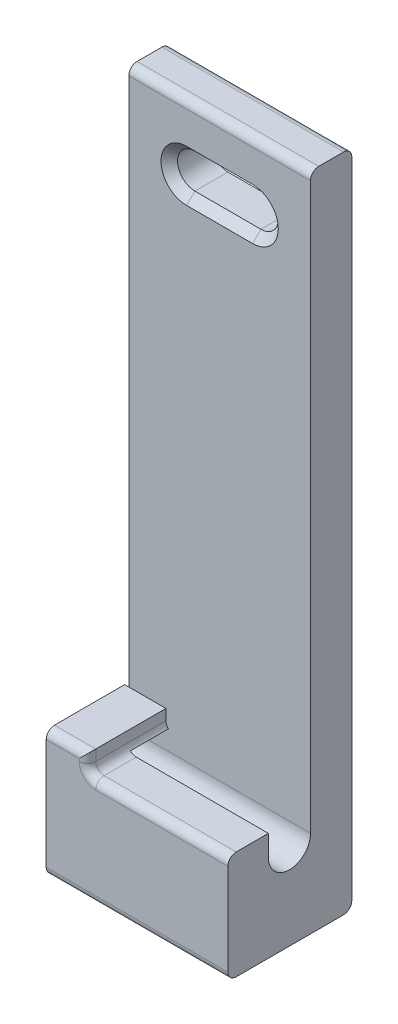
ISO-10303-21;
HEADER;
FILE_DESCRIPTION(('STEP AP214'),'2;1');
FILE_NAME('part.step','',(''),(''),'','','');
FILE_SCHEMA(('AUTOMOTIVE_DESIGN { 1 0 10303 214 1 1 1 1 }'));
ENDSEC;
DATA;
#1=APPLICATION_CONTEXT('core data for automotive mechanical design processes');
#2=APPLICATION_PROTOCOL_DEFINITION('international standard','automotive_design',2000,#1);
#3=PRODUCT_CONTEXT('',#1,'mechanical');
#4=PRODUCT('Part','Part','',(#3));
#5=PRODUCT_RELATED_PRODUCT_CATEGORY('part','',(#4));
#6=PRODUCT_DEFINITION_FORMATION('','',#4);
#7=PRODUCT_DEFINITION_CONTEXT('part definition',#1,'design');
#8=PRODUCT_DEFINITION('design','',#6,#7);
#9=PRODUCT_DEFINITION_SHAPE('','',#8);
#10=(LENGTH_UNIT() NAMED_UNIT(*) SI_UNIT(.MILLI.,.METRE.));
#11=(NAMED_UNIT(*) PLANE_ANGLE_UNIT() SI_UNIT($,.RADIAN.));
#12=(NAMED_UNIT(*) SI_UNIT($,.STERADIAN.) SOLID_ANGLE_UNIT());
#13=UNCERTAINTY_MEASURE_WITH_UNIT(LENGTH_MEASURE(1.E-05),#10,'distance_accuracy_value','');
#14=(GEOMETRIC_REPRESENTATION_CONTEXT(3) GLOBAL_UNCERTAINTY_ASSIGNED_CONTEXT((#13)) GLOBAL_UNIT_ASSIGNED_CONTEXT((#10,
#11,#12)) REPRESENTATION_CONTEXT('',''));
#15=CARTESIAN_POINT('',(0.,0.,0.));
#16=DIRECTION('',(0.,0.,1.));
#17=DIRECTION('',(1.,0.,0.));
#18=AXIS2_PLACEMENT_3D('',#15,#16,#17);
#19=CARTESIAN_POINT('',(0.,13.1,0.));
#20=DIRECTION('',(0.,-1.,0.));
#21=DIRECTION('',(0.,0.,-1.));
#22=AXIS2_PLACEMENT_3D('',#19,#20,#21);
#23=PLANE('',#22);
#24=DIRECTION('',(0.,0.,-1.));
#25=VECTOR('',#24,1.);
#26=CARTESIAN_POINT('',(6.,13.1,15.));
#27=LINE('',#26,#25);
#28=CARTESIAN_POINT('',(6.,13.1,10.1));
#29=VERTEX_POINT('',#28);
#30=CARTESIAN_POINT('',(6.,13.1,14.));
#31=VERTEX_POINT('',#30);
#32=EDGE_CURVE('E472',#29,#31,#27,.F.);
#33=ORIENTED_EDGE('',*,*,#32,.T.);
#34=DIRECTION('',(1.,0.,0.));
#35=VECTOR('',#34,1.);
#36=CARTESIAN_POINT('',(0.,13.1,14.));
#37=LINE('',#36,#35);
#38=CARTESIAN_POINT('',(22.,13.1,14.));
#39=VERTEX_POINT('',#38);
#40=EDGE_CURVE('E475',#31,#39,#37,.T.);
#41=ORIENTED_EDGE('',*,*,#40,.T.);
#42=DIRECTION('',(0.,0.,-1.));
#43=VECTOR('',#42,1.);
#44=CARTESIAN_POINT('',(22.,13.1,0.));
#45=LINE('',#44,#43);
#46=CARTESIAN_POINT('',(22.,13.1,10.1));
#47=VERTEX_POINT('',#46);
#48=EDGE_CURVE('E297',#39,#47,#45,.T.);
#49=ORIENTED_EDGE('',*,*,#48,.T.);
#50=DIRECTION('',(1.,0.,0.));
#51=VECTOR('',#50,1.);
#52=CARTESIAN_POINT('',(0.,13.1,10.1));
#53=LINE('',#52,#51);
#54=EDGE_CURVE('E320',#29,#47,#53,.T.);
#55=ORIENTED_EDGE('',*,*,#54,.F.);
#56=EDGE_LOOP('',(#33,#41,#49,#55));
#57=FACE_BOUND('',#56,.T.);
#58=ADVANCED_FACE('F47',(#57),#23,.F.);
#59=CARTESIAN_POINT('',(22.,0.,0.));
#60=DIRECTION('',(0.,0.,1.));
#61=DIRECTION('',(0.,-1.,0.));
#62=AXIS2_PLACEMENT_3D('',#59,#60,#61);
#63=PLANE('',#62);
#64=DIRECTION('',(-1.,0.,0.));
#65=VECTOR('',#64,1.);
#66=CARTESIAN_POINT('',(7.,74.1,0.));
#67=LINE('',#66,#65);
#68=CARTESIAN_POINT('',(15.,74.1,0.));
#69=VERTEX_POINT('',#68);
#70=CARTESIAN_POINT('',(7.,74.1,0.));
#71=VERTEX_POINT('',#70);
#72=EDGE_CURVE('E271',#69,#71,#67,.T.);
#73=ORIENTED_EDGE('',*,*,#72,.T.);
#74=CARTESIAN_POINT('',(7.,72.,0.));
#75=DIRECTION('',(0.,0.,1.));
#76=DIRECTION('',(1.,0.,0.));
#77=AXIS2_PLACEMENT_3D('',#74,#75,#76);
#78=CIRCLE('',#77,2.1);
#79=CARTESIAN_POINT('',(7.,69.9,0.));
#80=VERTEX_POINT('',#79);
#81=EDGE_CURVE('E258',#71,#80,#78,.T.);
#82=ORIENTED_EDGE('',*,*,#81,.T.);
#83=DIRECTION('',(1.,0.,0.));
#84=VECTOR('',#83,1.);
#85=CARTESIAN_POINT('',(7.,69.9,0.));
#86=LINE('',#85,#84);
#87=CARTESIAN_POINT('',(15.,69.9,0.));
#88=VERTEX_POINT('',#87);
#89=EDGE_CURVE('E262',#80,#88,#86,.T.);
#90=ORIENTED_EDGE('',*,*,#89,.T.);
#91=CARTESIAN_POINT('',(15.,72.,0.));
#92=DIRECTION('',(0.,0.,1.));
#93=DIRECTION('',(1.,0.,0.));
#94=AXIS2_PLACEMENT_3D('',#91,#92,#93);
#95=CIRCLE('',#94,2.1);
#96=EDGE_CURVE('E267',#88,#69,#95,.T.);
#97=ORIENTED_EDGE('',*,*,#96,.T.);
#98=EDGE_LOOP('',(#73,#82,#90,#97));
#99=FACE_BOUND('',#98,.T.);
#100=DIRECTION('',(0.,1.,0.));
#101=VECTOR('',#100,1.);
#102=CARTESIAN_POINT('',(22.,0.,0.));
#103=LINE('',#102,#101);
#104=CARTESIAN_POINT('',(22.,1.,0.));
#105=VERTEX_POINT('',#104);
#106=CARTESIAN_POINT('',(22.,79.,0.));
#107=VERTEX_POINT('',#106);
#108=EDGE_CURVE('E329',#105,#107,#103,.T.);
#109=ORIENTED_EDGE('',*,*,#108,.F.);
#110=DIRECTION('',(-1.,0.,0.));
#111=VECTOR('',#110,1.);
#112=CARTESIAN_POINT('',(22.,1.,0.));
#113=LINE('',#112,#111);
#114=CARTESIAN_POINT('',(0.,1.,0.));
#115=VERTEX_POINT('',#114);
#116=EDGE_CURVE('E420',#105,#115,#113,.T.);
#117=ORIENTED_EDGE('',*,*,#116,.T.);
#118=DIRECTION('',(0.,1.,0.));
#119=VECTOR('',#118,1.);
#120=CARTESIAN_POINT('',(0.,0.,0.));
#121=LINE('',#120,#119);
#122=CARTESIAN_POINT('',(0.,79.,0.));
#123=VERTEX_POINT('',#122);
#124=EDGE_CURVE('E323',#115,#123,#121,.T.);
#125=ORIENTED_EDGE('',*,*,#124,.T.);
#126=DIRECTION('',(-1.,0.,0.));
#127=VECTOR('',#126,1.);
#128=CARTESIAN_POINT('',(22.,79.,0.));
#129=LINE('',#128,#127);
#130=EDGE_CURVE('E417',#123,#107,#129,.F.);
#131=ORIENTED_EDGE('',*,*,#130,.T.);
#132=EDGE_LOOP('',(#109,#117,#125,#131));
#133=FACE_BOUND('',#132,.T.);
#134=ADVANCED_FACE('F552',(#99,#133),#63,.F.);
#135=CARTESIAN_POINT('',(22.,80.,0.));
#136=DIRECTION('',(0.,-1.,0.));
#137=DIRECTION('',(0.,0.,-1.));
#138=AXIS2_PLACEMENT_3D('',#135,#136,#137);
#139=PLANE('',#138);
#140=DIRECTION('',(0.,0.,1.));
#141=VECTOR('',#140,1.);
#142=CARTESIAN_POINT('',(22.,80.,0.));
#143=LINE('',#142,#141);
#144=CARTESIAN_POINT('',(22.,80.,1.));
#145=VERTEX_POINT('',#144);
#146=CARTESIAN_POINT('',(22.,80.,4.));
#147=VERTEX_POINT('',#146);
#148=EDGE_CURVE('E333',#145,#147,#143,.T.);
#149=ORIENTED_EDGE('',*,*,#148,.F.);
#150=DIRECTION('',(-1.,0.,0.));
#151=VECTOR('',#150,1.);
#152=CARTESIAN_POINT('',(22.,80.,1.));
#153=LINE('',#152,#151);
#154=CARTESIAN_POINT('',(0.,80.,1.));
#155=VERTEX_POINT('',#154);
#156=EDGE_CURVE('E465',#145,#155,#153,.T.);
#157=ORIENTED_EDGE('',*,*,#156,.T.);
#158=DIRECTION('',(0.,0.,1.));
#159=VECTOR('',#158,1.);
#160=CARTESIAN_POINT('',(0.,80.,0.));
#161=LINE('',#160,#159);
#162=CARTESIAN_POINT('',(0.,80.,4.));
#163=VERTEX_POINT('',#162);
#164=EDGE_CURVE('E350',#155,#163,#161,.T.);
#165=ORIENTED_EDGE('',*,*,#164,.T.);
#166=DIRECTION('',(1.,0.,0.));
#167=VECTOR('',#166,1.);
#168=CARTESIAN_POINT('',(22.,80.,4.));
#169=LINE('',#168,#167);
#170=EDGE_CURVE('E461',#163,#147,#169,.T.);
#171=ORIENTED_EDGE('',*,*,#170,.T.);
#172=EDGE_LOOP('',(#149,#157,#165,#171));
#173=FACE_BOUND('',#172,.T.);
#174=ADVANCED_FACE('F542',(#173),#139,.F.);
#175=CARTESIAN_POINT('',(22.,0.,15.));
#176=DIRECTION('',(0.,0.,-1.));
#177=DIRECTION('',(0.,1.,0.));
#178=AXIS2_PLACEMENT_3D('',#175,#176,#177);
#179=PLANE('',#178);
#180=DIRECTION('',(0.,-1.,0.));
#181=VECTOR('',#180,1.);
#182=CARTESIAN_POINT('',(0.,0.,15.));
#183=LINE('',#182,#181);
#184=CARTESIAN_POINT('',(0.,14.4,15.));
#185=VERTEX_POINT('',#184);
#186=CARTESIAN_POINT('',(0.,0.999999999999998,15.));
#187=VERTEX_POINT('',#186);
#188=EDGE_CURVE('E354',#185,#187,#183,.T.);
#189=ORIENTED_EDGE('',*,*,#188,.T.);
#190=DIRECTION('',(-1.,0.,0.));
#191=VECTOR('',#190,1.);
#192=CARTESIAN_POINT('',(22.,0.999999999999998,15.));
#193=LINE('',#192,#191);
#194=CARTESIAN_POINT('',(22.,0.999999999999998,15.));
#195=VERTEX_POINT('',#194);
#196=EDGE_CURVE('E409',#187,#195,#193,.F.);
#197=ORIENTED_EDGE('',*,*,#196,.T.);
#198=DIRECTION('',(0.,-1.,0.));
#199=VECTOR('',#198,1.);
#200=CARTESIAN_POINT('',(22.,0.,15.));
#201=LINE('',#200,#199);
#202=CARTESIAN_POINT('',(22.,12.1,15.));
#203=VERTEX_POINT('',#202);
#204=EDGE_CURVE('E338',#203,#195,#201,.T.);
#205=ORIENTED_EDGE('',*,*,#204,.F.);
#206=DIRECTION('',(1.,0.,0.));
#207=VECTOR('',#206,1.);
#208=CARTESIAN_POINT('',(22.,12.1,15.));
#209=LINE('',#208,#207);
#210=CARTESIAN_POINT('',(6.,12.1,15.));
#211=VERTEX_POINT('',#210);
#212=EDGE_CURVE('E406',#203,#211,#209,.F.);
#213=ORIENTED_EDGE('',*,*,#212,.T.);
#214=CARTESIAN_POINT('',(6.,14.1,15.));
#215=DIRECTION('',(0.,0.,-1.));
#216=DIRECTION('',(0.,1.,0.));
#217=AXIS2_PLACEMENT_3D('',#214,#215,#216);
#218=CIRCLE('',#217,2.);
#219=CARTESIAN_POINT('',(4.,14.1,15.));
#220=VERTEX_POINT('',#219);
#221=EDGE_CURVE('E402',#220,#211,#218,.F.);
#222=ORIENTED_EDGE('',*,*,#221,.F.);
#223=DIRECTION('',(0.,1.,0.));
#224=VECTOR('',#223,1.);
#225=CARTESIAN_POINT('',(4.,0.,15.));
#226=LINE('',#225,#224);
#227=CARTESIAN_POINT('',(4.,14.4,15.));
#228=VERTEX_POINT('',#227);
#229=EDGE_CURVE('E398',#220,#228,#226,.T.);
#230=ORIENTED_EDGE('',*,*,#229,.T.);
#231=DIRECTION('',(-1.,0.,0.));
#232=VECTOR('',#231,1.);
#233=CARTESIAN_POINT('',(0.,14.4,15.));
#234=LINE('',#233,#232);
#235=EDGE_CURVE('E385',#228,#185,#234,.T.);
#236=ORIENTED_EDGE('',*,*,#235,.T.);
#237=EDGE_LOOP('',(#189,#197,#205,#213,#222,#230,#236));
#238=FACE_BOUND('',#237,.T.);
#239=ADVANCED_FACE('F567',(#238),#179,.F.);
#240=CARTESIAN_POINT('',(22.,0.,0.));
#241=DIRECTION('',(0.,1.,0.));
#242=DIRECTION('',(0.,0.,1.));
#243=AXIS2_PLACEMENT_3D('',#240,#241,#242);
#244=PLANE('',#243);
#245=DIRECTION('',(0.,0.,-1.));
#246=VECTOR('',#245,1.);
#247=CARTESIAN_POINT('',(0.,0.,0.));
#248=LINE('',#247,#246);
#249=CARTESIAN_POINT('',(0.,0.,14.));
#250=VERTEX_POINT('',#249);
#251=CARTESIAN_POINT('',(0.,0.,1.));
#252=VERTEX_POINT('',#251);
#253=EDGE_CURVE('E334',#250,#252,#248,.T.);
#254=ORIENTED_EDGE('',*,*,#253,.T.);
#255=DIRECTION('',(-1.,0.,0.));
#256=VECTOR('',#255,1.);
#257=CARTESIAN_POINT('',(22.,0.,1.));
#258=LINE('',#257,#256);
#259=CARTESIAN_POINT('',(22.,0.,1.));
#260=VERTEX_POINT('',#259);
#261=EDGE_CURVE('E443',#252,#260,#258,.F.);
#262=ORIENTED_EDGE('',*,*,#261,.T.);
#263=DIRECTION('',(0.,0.,-1.));
#264=VECTOR('',#263,1.);
#265=CARTESIAN_POINT('',(22.,0.,0.));
#266=LINE('',#265,#264);
#267=CARTESIAN_POINT('',(22.,0.,14.));
#268=VERTEX_POINT('',#267);
#269=EDGE_CURVE('E342',#268,#260,#266,.T.);
#270=ORIENTED_EDGE('',*,*,#269,.F.);
#271=DIRECTION('',(-1.,0.,0.));
#272=VECTOR('',#271,1.);
#273=CARTESIAN_POINT('',(22.,0.,14.));
#274=LINE('',#273,#272);
#275=EDGE_CURVE('E439',#268,#250,#274,.T.);
#276=ORIENTED_EDGE('',*,*,#275,.T.);
#277=EDGE_LOOP('',(#254,#262,#270,#276));
#278=FACE_BOUND('',#277,.T.);
#279=ADVANCED_FACE('F560',(#278),#244,.F.);
#280=CARTESIAN_POINT('',(22.,0.,0.));
#281=DIRECTION('',(1.,0.,0.));
#282=DIRECTION('',(0.,0.,-1.));
#283=AXIS2_PLACEMENT_3D('',#280,#281,#282);
#284=PLANE('',#283);
#285=ORIENTED_EDGE('',*,*,#269,.T.);
#286=CARTESIAN_POINT('',(22.,1.,1.));
#287=DIRECTION('',(1.,0.,0.));
#288=DIRECTION('',(0.,0.,-1.));
#289=AXIS2_PLACEMENT_3D('',#286,#287,#288);
#290=CIRCLE('',#289,1.);
#291=EDGE_CURVE('E458',#260,#105,#290,.T.);
#292=ORIENTED_EDGE('',*,*,#291,.T.);
#293=ORIENTED_EDGE('',*,*,#108,.T.);
#294=CARTESIAN_POINT('',(22.,79.,1.));
#295=DIRECTION('',(1.,0.,0.));
#296=DIRECTION('',(0.,0.,-1.));
#297=AXIS2_PLACEMENT_3D('',#294,#295,#296);
#298=CIRCLE('',#297,1.);
#299=EDGE_CURVE('E455',#107,#145,#298,.T.);
#300=ORIENTED_EDGE('',*,*,#299,.T.);
#301=ORIENTED_EDGE('',*,*,#148,.T.);
#302=CARTESIAN_POINT('',(22.,79.,4.));
#303=DIRECTION('',(1.,0.,0.));
#304=DIRECTION('',(0.,0.,-1.));
#305=AXIS2_PLACEMENT_3D('',#302,#303,#304);
#306=CIRCLE('',#305,1.);
#307=CARTESIAN_POINT('',(22.,79.,5.));
#308=VERTEX_POINT('',#307);
#309=EDGE_CURVE('E452',#147,#308,#306,.T.);
#310=ORIENTED_EDGE('',*,*,#309,.T.);
#311=DIRECTION('',(0.,1.,0.));
#312=VECTOR('',#311,1.);
#313=CARTESIAN_POINT('',(22.,0.,5.));
#314=LINE('',#313,#312);
#315=CARTESIAN_POINT('',(22.,10.55,5.));
#316=VERTEX_POINT('',#315);
#317=EDGE_CURVE('E313',#316,#308,#314,.T.);
#318=ORIENTED_EDGE('',*,*,#317,.F.);
#319=CARTESIAN_POINT('',(22.,10.55,7.55));
#320=DIRECTION('',(1.,0.,0.));
#321=DIRECTION('',(0.,0.,-1.));
#322=AXIS2_PLACEMENT_3D('',#319,#320,#321);
#323=CIRCLE('',#322,2.55);
#324=CARTESIAN_POINT('',(22.,10.55,10.1));
#325=VERTEX_POINT('',#324);
#326=EDGE_CURVE('E309',#325,#316,#323,.T.);
#327=ORIENTED_EDGE('',*,*,#326,.F.);
#328=DIRECTION('',(0.,-1.,0.));
#329=VECTOR('',#328,1.);
#330=CARTESIAN_POINT('',(22.,0.,10.1));
#331=LINE('',#330,#329);
#332=EDGE_CURVE('E280',#47,#325,#331,.T.);
#333=ORIENTED_EDGE('',*,*,#332,.F.);
#334=ORIENTED_EDGE('',*,*,#48,.F.);
#335=CARTESIAN_POINT('',(22.,12.1,14.));
#336=DIRECTION('',(1.,0.,0.));
#337=DIRECTION('',(0.,0.,-1.));
#338=AXIS2_PLACEMENT_3D('',#335,#336,#337);
#339=CIRCLE('',#338,1.);
#340=EDGE_CURVE('E449',#39,#203,#339,.T.);
#341=ORIENTED_EDGE('',*,*,#340,.T.);
#342=ORIENTED_EDGE('',*,*,#204,.T.);
#343=CARTESIAN_POINT('',(22.,0.999999999999998,14.));
#344=DIRECTION('',(1.,0.,0.));
#345=DIRECTION('',(0.,0.,-1.));
#346=AXIS2_PLACEMENT_3D('',#343,#344,#345);
#347=CIRCLE('',#346,1.);
#348=EDGE_CURVE('E446',#195,#268,#347,.T.);
#349=ORIENTED_EDGE('',*,*,#348,.T.);
#350=EDGE_LOOP('',(#285,#292,#293,#300,#301,#310,#318,#327,#333,#334,#341,#342,#349));
#351=FACE_BOUND('',#350,.T.);
#352=ADVANCED_FACE('F545',(#351),#284,.T.);
#353=CARTESIAN_POINT('',(0.,0.,0.));
#354=DIRECTION('',(1.,0.,0.));
#355=DIRECTION('',(0.,0.,-1.));
#356=AXIS2_PLACEMENT_3D('',#353,#354,#355);
#357=PLANE('',#356);
#358=ORIENTED_EDGE('',*,*,#124,.F.);
#359=CARTESIAN_POINT('',(0.,1.,1.));
#360=DIRECTION('',(1.,0.,0.));
#361=DIRECTION('',(0.,0.,-1.));
#362=AXIS2_PLACEMENT_3D('',#359,#360,#361);
#363=CIRCLE('',#362,1.);
#364=EDGE_CURVE('E436',#115,#252,#363,.F.);
#365=ORIENTED_EDGE('',*,*,#364,.T.);
#366=ORIENTED_EDGE('',*,*,#253,.F.);
#367=CARTESIAN_POINT('',(0.,0.999999999999998,14.));
#368=DIRECTION('',(1.,0.,0.));
#369=DIRECTION('',(0.,0.,-1.));
#370=AXIS2_PLACEMENT_3D('',#367,#368,#369);
#371=CIRCLE('',#370,1.);
#372=EDGE_CURVE('E427',#250,#187,#371,.F.);
#373=ORIENTED_EDGE('',*,*,#372,.T.);
#374=ORIENTED_EDGE('',*,*,#188,.F.);
#375=CARTESIAN_POINT('',(0.,14.4,14.));
#376=DIRECTION('',(1.,0.,0.));
#377=DIRECTION('',(0.,0.,-1.));
#378=AXIS2_PLACEMENT_3D('',#375,#376,#377);
#379=CIRCLE('',#378,1.);
#380=CARTESIAN_POINT('',(0.,15.4,14.));
#381=VERTEX_POINT('',#380);
#382=EDGE_CURVE('E424',#185,#381,#379,.F.);
#383=ORIENTED_EDGE('',*,*,#382,.T.);
#384=DIRECTION('',(0.,0.,-1.));
#385=VECTOR('',#384,1.);
#386=CARTESIAN_POINT('',(0.,15.4,0.));
#387=LINE('',#386,#385);
#388=CARTESIAN_POINT('',(0.,15.4,5.5));
#389=VERTEX_POINT('',#388);
#390=EDGE_CURVE('E240',#381,#389,#387,.T.);
#391=ORIENTED_EDGE('',*,*,#390,.T.);
#392=DIRECTION('',(0.,1.,0.));
#393=VECTOR('',#392,1.);
#394=CARTESIAN_POINT('',(0.,0.,5.5));
#395=LINE('',#394,#393);
#396=CARTESIAN_POINT('',(0.,13.4,5.5));
#397=VERTEX_POINT('',#396);
#398=EDGE_CURVE('E244',#397,#389,#395,.T.);
#399=ORIENTED_EDGE('',*,*,#398,.F.);
#400=DIRECTION('',(0.,0.,-1.));
#401=VECTOR('',#400,1.);
#402=CARTESIAN_POINT('',(0.,13.4,0.));
#403=LINE('',#402,#401);
#404=CARTESIAN_POINT('',(0.,13.4,10.1));
#405=VERTEX_POINT('',#404);
#406=EDGE_CURVE('E501',#405,#397,#403,.T.);
#407=ORIENTED_EDGE('',*,*,#406,.F.);
#408=DIRECTION('',(0.,-1.,0.));
#409=VECTOR('',#408,1.);
#410=CARTESIAN_POINT('',(0.,0.,10.1));
#411=LINE('',#410,#409);
#412=CARTESIAN_POINT('',(0.,10.55,10.1));
#413=VERTEX_POINT('',#412);
#414=EDGE_CURVE('E292',#405,#413,#411,.T.);
#415=ORIENTED_EDGE('',*,*,#414,.T.);
#416=CARTESIAN_POINT('',(0.,10.55,7.55));
#417=DIRECTION('',(1.,0.,0.));
#418=DIRECTION('',(0.,0.,-1.));
#419=AXIS2_PLACEMENT_3D('',#416,#417,#418);
#420=CIRCLE('',#419,2.55);
#421=CARTESIAN_POINT('',(0.,10.55,5.));
#422=VERTEX_POINT('',#421);
#423=EDGE_CURVE('E296',#413,#422,#420,.T.);
#424=ORIENTED_EDGE('',*,*,#423,.T.);
#425=DIRECTION('',(0.,1.,0.));
#426=VECTOR('',#425,1.);
#427=CARTESIAN_POINT('',(0.,0.,5.));
#428=LINE('',#427,#426);
#429=CARTESIAN_POINT('',(0.,79.,5.));
#430=VERTEX_POINT('',#429);
#431=EDGE_CURVE('E301',#422,#430,#428,.T.);
#432=ORIENTED_EDGE('',*,*,#431,.T.);
#433=CARTESIAN_POINT('',(0.,79.,4.));
#434=DIRECTION('',(1.,0.,0.));
#435=DIRECTION('',(0.,0.,-1.));
#436=AXIS2_PLACEMENT_3D('',#433,#434,#435);
#437=CIRCLE('',#436,1.);
#438=EDGE_CURVE('E430',#430,#163,#437,.F.);
#439=ORIENTED_EDGE('',*,*,#438,.T.);
#440=ORIENTED_EDGE('',*,*,#164,.F.);
#441=CARTESIAN_POINT('',(0.,79.,1.));
#442=DIRECTION('',(1.,0.,0.));
#443=DIRECTION('',(0.,0.,-1.));
#444=AXIS2_PLACEMENT_3D('',#441,#442,#443);
#445=CIRCLE('',#444,1.);
#446=EDGE_CURVE('E433',#155,#123,#445,.F.);
#447=ORIENTED_EDGE('',*,*,#446,.T.);
#448=EDGE_LOOP('',(#358,#365,#366,#373,#374,#383,#391,#399,#407,#415,#424,#432,#439,#440,#447));
#449=FACE_BOUND('',#448,.T.);
#450=ADVANCED_FACE('F508',(#449),#357,.F.);
#451=CARTESIAN_POINT('',(0.,0.,10.1));
#452=DIRECTION('',(0.,0.,1.));
#453=DIRECTION('',(0.,-1.,0.));
#454=AXIS2_PLACEMENT_3D('',#451,#452,#453);
#455=PLANE('',#454);
#456=ORIENTED_EDGE('',*,*,#332,.T.);
#457=DIRECTION('',(1.,0.,0.));
#458=VECTOR('',#457,1.);
#459=CARTESIAN_POINT('',(0.,10.55,10.1));
#460=LINE('',#459,#458);
#461=EDGE_CURVE('E305',#413,#325,#460,.T.);
#462=ORIENTED_EDGE('',*,*,#461,.F.);
#463=ORIENTED_EDGE('',*,*,#414,.F.);
#464=DIRECTION('',(-1.,0.,0.));
#465=VECTOR('',#464,1.);
#466=CARTESIAN_POINT('',(5.,13.4,10.1));
#467=LINE('',#466,#465);
#468=CARTESIAN_POINT('',(5.28585715714572,13.4,10.1));
#469=VERTEX_POINT('',#468);
#470=EDGE_CURVE('E64',#469,#405,#467,.T.);
#471=ORIENTED_EDGE('',*,*,#470,.F.);
#472=CARTESIAN_POINT('',(6.,14.1,10.1));
#473=DIRECTION('',(0.,0.,1.));
#474=DIRECTION('',(0.,-1.,0.));
#475=AXIS2_PLACEMENT_3D('',#472,#473,#474);
#476=CIRCLE('',#475,1.);
#477=EDGE_CURVE('E11',#469,#29,#476,.T.);
#478=ORIENTED_EDGE('',*,*,#477,.T.);
#479=ORIENTED_EDGE('',*,*,#54,.T.);
#480=EDGE_LOOP('',(#456,#462,#463,#471,#478,#479));
#481=FACE_BOUND('',#480,.T.);
#482=ADVANCED_FACE('F525',(#481),#455,.F.);
#483=CARTESIAN_POINT('',(0.,0.,5.));
#484=DIRECTION('',(0.,0.,-1.));
#485=DIRECTION('',(-1.,0.,0.));
#486=AXIS2_PLACEMENT_3D('',#483,#484,#485);
#487=PLANE('',#486);
#488=CARTESIAN_POINT('',(15.,72.,5.));
#489=DIRECTION('',(0.,0.,-1.));
#490=DIRECTION('',(-1.,0.,0.));
#491=AXIS2_PLACEMENT_3D('',#488,#489,#490);
#492=CIRCLE('',#491,3.10000000000002);
#493=CARTESIAN_POINT('',(15.,75.1,5.));
#494=VERTEX_POINT('',#493);
#495=CARTESIAN_POINT('',(15.,68.9,5.));
#496=VERTEX_POINT('',#495);
#497=EDGE_CURVE('E370',#494,#496,#492,.T.);
#498=ORIENTED_EDGE('',*,*,#497,.T.);
#499=DIRECTION('',(-1.,0.,0.));
#500=VECTOR('',#499,1.);
#501=CARTESIAN_POINT('',(0.,68.9,5.));
#502=LINE('',#501,#500);
#503=CARTESIAN_POINT('',(7.,68.9,5.));
#504=VERTEX_POINT('',#503);
#505=EDGE_CURVE('E373',#496,#504,#502,.T.);
#506=ORIENTED_EDGE('',*,*,#505,.T.);
#507=CARTESIAN_POINT('',(7.,72.,5.));
#508=DIRECTION('',(0.,0.,-1.));
#509=DIRECTION('',(-1.,0.,0.));
#510=AXIS2_PLACEMENT_3D('',#507,#508,#509);
#511=CIRCLE('',#510,3.10000000000002);
#512=CARTESIAN_POINT('',(7.,75.1,5.));
#513=VERTEX_POINT('',#512);
#514=EDGE_CURVE('E367',#504,#513,#511,.T.);
#515=ORIENTED_EDGE('',*,*,#514,.T.);
#516=DIRECTION('',(1.,0.,0.));
#517=VECTOR('',#516,1.);
#518=CARTESIAN_POINT('',(0.,75.1,5.));
#519=LINE('',#518,#517);
#520=EDGE_CURVE('E364',#513,#494,#519,.T.);
#521=ORIENTED_EDGE('',*,*,#520,.T.);
#522=EDGE_LOOP('',(#498,#506,#515,#521));
#523=FACE_BOUND('',#522,.T.);
#524=ORIENTED_EDGE('',*,*,#317,.T.);
#525=DIRECTION('',(1.,0.,0.));
#526=VECTOR('',#525,1.);
#527=CARTESIAN_POINT('',(0.,79.,5.));
#528=LINE('',#527,#526);
#529=EDGE_CURVE('E469',#308,#430,#528,.F.);
#530=ORIENTED_EDGE('',*,*,#529,.T.);
#531=ORIENTED_EDGE('',*,*,#431,.F.);
#532=DIRECTION('',(1.,0.,0.));
#533=VECTOR('',#532,1.);
#534=CARTESIAN_POINT('',(0.,10.55,5.));
#535=LINE('',#534,#533);
#536=EDGE_CURVE('E324',#422,#316,#535,.T.);
#537=ORIENTED_EDGE('',*,*,#536,.T.);
#538=EDGE_LOOP('',(#524,#530,#531,#537));
#539=FACE_BOUND('',#538,.T.);
#540=ADVANCED_FACE('F533',(#523,#539),#487,.F.);
#541=CARTESIAN_POINT('',(0.,10.55,7.55));
#542=DIRECTION('',(1.,0.,0.));
#543=DIRECTION('',(0.,0.,-1.));
#544=AXIS2_PLACEMENT_3D('',#541,#542,#543);
#545=CYLINDRICAL_SURFACE('',#544,2.55);
#546=ORIENTED_EDGE('',*,*,#326,.T.);
#547=ORIENTED_EDGE('',*,*,#536,.F.);
#548=ORIENTED_EDGE('',*,*,#423,.F.);
#549=ORIENTED_EDGE('',*,*,#461,.T.);
#550=EDGE_LOOP('',(#546,#547,#548,#549));
#551=FACE_BOUND('',#550,.T.);
#552=ADVANCED_FACE('F530',(#551),#545,.F.);
#553=CARTESIAN_POINT('',(7.,72.,0.));
#554=DIRECTION('',(0.,0.,1.));
#555=DIRECTION('',(1.,0.,0.));
#556=AXIS2_PLACEMENT_3D('',#553,#554,#555);
#557=CYLINDRICAL_SURFACE('',#556,2.1);
#558=DIRECTION('',(0.,0.,1.));
#559=VECTOR('',#558,1.);
#560=CARTESIAN_POINT('',(7.,74.1,0.));
#561=LINE('',#560,#559);
#562=CARTESIAN_POINT('',(7.,74.1,3.99999999999999));
#563=VERTEX_POINT('',#562);
#564=EDGE_CURVE('E276',#71,#563,#561,.T.);
#565=ORIENTED_EDGE('',*,*,#564,.T.);
#566=CARTESIAN_POINT('',(7.,72.,3.99999999999999));
#567=DIRECTION('',(0.,0.,-1.));
#568=DIRECTION('',(-1.,0.,0.));
#569=AXIS2_PLACEMENT_3D('',#566,#567,#568);
#570=CIRCLE('',#569,2.1);
#571=CARTESIAN_POINT('',(7.,69.9,3.99999999999999));
#572=VERTEX_POINT('',#571);
#573=EDGE_CURVE('E380',#563,#572,#570,.F.);
#574=ORIENTED_EDGE('',*,*,#573,.T.);
#575=DIRECTION('',(0.,0.,1.));
#576=VECTOR('',#575,1.);
#577=CARTESIAN_POINT('',(7.,69.9,0.));
#578=LINE('',#577,#576);
#579=EDGE_CURVE('E275',#80,#572,#578,.T.);
#580=ORIENTED_EDGE('',*,*,#579,.F.);
#581=ORIENTED_EDGE('',*,*,#81,.F.);
#582=EDGE_LOOP('',(#565,#574,#580,#581));
#583=FACE_BOUND('',#582,.T.);
#584=ADVANCED_FACE('F591',(#583),#557,.F.);
#585=CARTESIAN_POINT('',(7.,74.1,0.));
#586=DIRECTION('',(0.,1.,0.));
#587=DIRECTION('',(0.,0.,1.));
#588=AXIS2_PLACEMENT_3D('',#585,#586,#587);
#589=PLANE('',#588);
#590=DIRECTION('',(0.,0.,1.));
#591=VECTOR('',#590,1.);
#592=CARTESIAN_POINT('',(15.,74.1,0.));
#593=LINE('',#592,#591);
#594=CARTESIAN_POINT('',(15.,74.1,3.99999999999999));
#595=VERTEX_POINT('',#594);
#596=EDGE_CURVE('E281',#69,#595,#593,.T.);
#597=ORIENTED_EDGE('',*,*,#596,.T.);
#598=DIRECTION('',(-1.,0.,0.));
#599=VECTOR('',#598,1.);
#600=CARTESIAN_POINT('',(7.,74.1,3.99999999999999));
#601=LINE('',#600,#599);
#602=EDGE_CURVE('E383',#595,#563,#601,.T.);
#603=ORIENTED_EDGE('',*,*,#602,.T.);
#604=ORIENTED_EDGE('',*,*,#564,.F.);
#605=ORIENTED_EDGE('',*,*,#72,.F.);
#606=EDGE_LOOP('',(#597,#603,#604,#605));
#607=FACE_BOUND('',#606,.T.);
#608=ADVANCED_FACE('F851',(#607),#589,.F.);
#609=CARTESIAN_POINT('',(15.,72.,0.));
#610=DIRECTION('',(0.,0.,1.));
#611=DIRECTION('',(1.,0.,0.));
#612=AXIS2_PLACEMENT_3D('',#609,#610,#611);
#613=CYLINDRICAL_SURFACE('',#612,2.1);
#614=DIRECTION('',(0.,0.,1.));
#615=VECTOR('',#614,1.);
#616=CARTESIAN_POINT('',(15.,69.9,0.));
#617=LINE('',#616,#615);
#618=CARTESIAN_POINT('',(15.,69.9,3.99999999999999));
#619=VERTEX_POINT('',#618);
#620=EDGE_CURVE('E285',#88,#619,#617,.T.);
#621=ORIENTED_EDGE('',*,*,#620,.T.);
#622=CARTESIAN_POINT('',(15.,72.,3.99999999999999));
#623=DIRECTION('',(0.,0.,-1.));
#624=DIRECTION('',(-1.,0.,0.));
#625=AXIS2_PLACEMENT_3D('',#622,#623,#624);
#626=CIRCLE('',#625,2.1);
#627=EDGE_CURVE('E377',#619,#595,#626,.F.);
#628=ORIENTED_EDGE('',*,*,#627,.T.);
#629=ORIENTED_EDGE('',*,*,#596,.F.);
#630=ORIENTED_EDGE('',*,*,#96,.F.);
#631=EDGE_LOOP('',(#621,#628,#629,#630));
#632=FACE_BOUND('',#631,.T.);
#633=ADVANCED_FACE('F841',(#632),#613,.F.);
#634=CARTESIAN_POINT('',(7.,69.9,0.));
#635=DIRECTION('',(0.,-1.,0.));
#636=DIRECTION('',(0.,0.,-1.));
#637=AXIS2_PLACEMENT_3D('',#634,#635,#636);
#638=PLANE('',#637);
#639=ORIENTED_EDGE('',*,*,#579,.T.);
#640=DIRECTION('',(1.,0.,0.));
#641=VECTOR('',#640,1.);
#642=CARTESIAN_POINT('',(7.,69.9,3.99999999999999));
#643=LINE('',#642,#641);
#644=EDGE_CURVE('E346',#572,#619,#643,.T.);
#645=ORIENTED_EDGE('',*,*,#644,.T.);
#646=ORIENTED_EDGE('',*,*,#620,.F.);
#647=ORIENTED_EDGE('',*,*,#89,.F.);
#648=EDGE_LOOP('',(#639,#645,#646,#647));
#649=FACE_BOUND('',#648,.T.);
#650=ADVANCED_FACE('F637',(#649),#638,.F.);
#651=CARTESIAN_POINT('',(7.,74.1,3.99999999999999));
#652=DIRECTION('',(0.,0.707106781186545,-0.70710678118655));
#653=DIRECTION('',(-1.,0.,0.));
#654=AXIS2_PLACEMENT_3D('',#651,#652,#653);
#655=PLANE('',#654);
#656=DIRECTION('',(0.,-0.70710678118655,-0.707106781186545));
#657=VECTOR('',#656,1.);
#658=CARTESIAN_POINT('',(15.,75.1,5.));
#659=LINE('',#658,#657);
#660=EDGE_CURVE('E389',#494,#595,#659,.T.);
#661=ORIENTED_EDGE('',*,*,#660,.F.);
#662=ORIENTED_EDGE('',*,*,#520,.F.);
#663=DIRECTION('',(0.,0.70710678118655,0.707106781186545));
#664=VECTOR('',#663,1.);
#665=CARTESIAN_POINT('',(7.,74.1,3.99999999999999));
#666=LINE('',#665,#664);
#667=EDGE_CURVE('E263',#563,#513,#666,.T.);
#668=ORIENTED_EDGE('',*,*,#667,.F.);
#669=ORIENTED_EDGE('',*,*,#602,.F.);
#670=EDGE_LOOP('',(#661,#662,#668,#669));
#671=FACE_BOUND('',#670,.T.);
#672=ADVANCED_FACE('F631',(#671),#655,.F.);
#673=CARTESIAN_POINT('',(7.,72.,3.99999999999999));
#674=DIRECTION('',(0.,0.,1.));
#675=DIRECTION('',(1.,0.,0.));
#676=AXIS2_PLACEMENT_3D('',#673,#674,#675);
#677=CONICAL_SURFACE('',#676,2.1,0.785398163397452);
#678=ORIENTED_EDGE('',*,*,#667,.T.);
#679=ORIENTED_EDGE('',*,*,#514,.F.);
#680=DIRECTION('',(0.,-0.70710678118655,0.707106781186545));
#681=VECTOR('',#680,1.);
#682=CARTESIAN_POINT('',(7.,69.9,3.99999999999999));
#683=LINE('',#682,#681);
#684=EDGE_CURVE('E250',#572,#504,#683,.T.);
#685=ORIENTED_EDGE('',*,*,#684,.F.);
#686=ORIENTED_EDGE('',*,*,#573,.F.);
#687=EDGE_LOOP('',(#678,#679,#685,#686));
#688=FACE_BOUND('',#687,.T.);
#689=ADVANCED_FACE('F624',(#688),#677,.F.);
#690=CARTESIAN_POINT('',(15.,72.,3.99999999999999));
#691=DIRECTION('',(0.,0.,1.));
#692=DIRECTION('',(1.,0.,0.));
#693=AXIS2_PLACEMENT_3D('',#690,#691,#692);
#694=CONICAL_SURFACE('',#693,2.1,0.785398163397452);
#695=ORIENTED_EDGE('',*,*,#660,.T.);
#696=ORIENTED_EDGE('',*,*,#627,.F.);
#697=DIRECTION('',(0.,0.70710678118655,-0.707106781186545));
#698=VECTOR('',#697,1.);
#699=CARTESIAN_POINT('',(15.,68.9,5.));
#700=LINE('',#699,#698);
#701=EDGE_CURVE('E246',#496,#619,#700,.T.);
#702=ORIENTED_EDGE('',*,*,#701,.F.);
#703=ORIENTED_EDGE('',*,*,#497,.F.);
#704=EDGE_LOOP('',(#695,#696,#702,#703));
#705=FACE_BOUND('',#704,.T.);
#706=ADVANCED_FACE('F617',(#705),#694,.F.);
#707=CARTESIAN_POINT('',(7.,69.9,3.99999999999999));
#708=DIRECTION('',(0.,-0.707106781186545,-0.70710678118655));
#709=DIRECTION('',(1.,0.,0.));
#710=AXIS2_PLACEMENT_3D('',#707,#708,#709);
#711=PLANE('',#710);
#712=ORIENTED_EDGE('',*,*,#684,.T.);
#713=ORIENTED_EDGE('',*,*,#505,.F.);
#714=ORIENTED_EDGE('',*,*,#701,.T.);
#715=ORIENTED_EDGE('',*,*,#644,.F.);
#716=EDGE_LOOP('',(#712,#713,#714,#715));
#717=FACE_BOUND('',#716,.T.);
#718=ADVANCED_FACE('F611',(#717),#711,.F.);
#719=CARTESIAN_POINT('',(5.,0.,5.5));
#720=DIRECTION('',(0.,0.,1.));
#721=DIRECTION('',(1.,0.,0.));
#722=AXIS2_PLACEMENT_3D('',#719,#720,#721);
#723=PLANE('',#722);
#724=ORIENTED_EDGE('',*,*,#398,.T.);
#725=DIRECTION('',(-1.,0.,0.));
#726=VECTOR('',#725,1.);
#727=CARTESIAN_POINT('',(5.,15.4,5.5));
#728=LINE('',#727,#726);
#729=CARTESIAN_POINT('',(5.,15.4,5.5));
#730=VERTEX_POINT('',#729);
#731=EDGE_CURVE('E224',#730,#389,#728,.T.);
#732=ORIENTED_EDGE('',*,*,#731,.F.);
#733=DIRECTION('',(0.,1.,0.));
#734=VECTOR('',#733,1.);
#735=CARTESIAN_POINT('',(5.,0.,5.5));
#736=LINE('',#735,#734);
#737=CARTESIAN_POINT('',(5.,14.1,5.5));
#738=VERTEX_POINT('',#737);
#739=EDGE_CURVE('E231',#738,#730,#736,.T.);
#740=ORIENTED_EDGE('',*,*,#739,.F.);
#741=CARTESIAN_POINT('',(6.,14.1,5.5));
#742=DIRECTION('',(0.,0.,1.));
#743=DIRECTION('',(1.,0.,0.));
#744=AXIS2_PLACEMENT_3D('',#741,#742,#743);
#745=CIRCLE('',#744,1.);
#746=CARTESIAN_POINT('',(5.28585715714572,13.4,5.5));
#747=VERTEX_POINT('',#746);
#748=EDGE_CURVE('E480',#738,#747,#745,.T.);
#749=ORIENTED_EDGE('',*,*,#748,.T.);
#750=DIRECTION('',(-1.,0.,0.));
#751=VECTOR('',#750,1.);
#752=CARTESIAN_POINT('',(5.,13.4,5.5));
#753=LINE('',#752,#751);
#754=EDGE_CURVE('E71',#747,#397,#753,.T.);
#755=ORIENTED_EDGE('',*,*,#754,.T.);
#756=EDGE_LOOP('',(#724,#732,#740,#749,#755));
#757=FACE_BOUND('',#756,.T.);
#758=ADVANCED_FACE('F242',(#757),#723,.F.);
#759=CARTESIAN_POINT('',(5.,15.4,0.));
#760=DIRECTION('',(0.,1.,0.));
#761=DIRECTION('',(0.,0.,1.));
#762=AXIS2_PLACEMENT_3D('',#759,#760,#761);
#763=PLANE('',#762);
#764=ORIENTED_EDGE('',*,*,#390,.F.);
#765=DIRECTION('',(-1.,0.,0.));
#766=VECTOR('',#765,1.);
#767=CARTESIAN_POINT('',(5.,15.4,14.));
#768=LINE('',#767,#766);
#769=CARTESIAN_POINT('',(5.,15.4,14.));
#770=VERTEX_POINT('',#769);
#771=EDGE_CURVE('E227',#381,#770,#768,.F.);
#772=ORIENTED_EDGE('',*,*,#771,.T.);
#773=DIRECTION('',(0.,0.,-1.));
#774=VECTOR('',#773,1.);
#775=CARTESIAN_POINT('',(5.,15.4,0.));
#776=LINE('',#775,#774);
#777=EDGE_CURVE('E219',#770,#730,#776,.T.);
#778=ORIENTED_EDGE('',*,*,#777,.T.);
#779=ORIENTED_EDGE('',*,*,#731,.T.);
#780=EDGE_LOOP('',(#764,#772,#778,#779));
#781=FACE_BOUND('',#780,.T.);
#782=ADVANCED_FACE('F222',(#781),#763,.T.);
#783=CARTESIAN_POINT('',(5.,13.4,0.));
#784=DIRECTION('',(0.,1.,0.));
#785=DIRECTION('',(0.,0.,1.));
#786=AXIS2_PLACEMENT_3D('',#783,#784,#785);
#787=PLANE('',#786);
#788=ORIENTED_EDGE('',*,*,#406,.T.);
#789=ORIENTED_EDGE('',*,*,#754,.F.);
#790=DIRECTION('',(0.,0.,1.));
#791=VECTOR('',#790,1.);
#792=CARTESIAN_POINT('',(5.28585715714572,13.4,5.5));
#793=LINE('',#792,#791);
#794=EDGE_CURVE('E57',#747,#469,#793,.T.);
#795=ORIENTED_EDGE('',*,*,#794,.T.);
#796=ORIENTED_EDGE('',*,*,#470,.T.);
#797=EDGE_LOOP('',(#788,#789,#795,#796));
#798=FACE_BOUND('',#797,.T.);
#799=ADVANCED_FACE('F523',(#798),#787,.F.);
#800=CARTESIAN_POINT('',(5.,0.,0.));
#801=DIRECTION('',(-1.,0.,0.));
#802=DIRECTION('',(0.,0.,1.));
#803=AXIS2_PLACEMENT_3D('',#800,#801,#802);
#804=PLANE('',#803);
#805=ORIENTED_EDGE('',*,*,#777,.F.);
#806=DIRECTION('',(0.,1.,0.));
#807=VECTOR('',#806,1.);
#808=CARTESIAN_POINT('',(5.,0.,14.));
#809=LINE('',#808,#807);
#810=CARTESIAN_POINT('',(5.,14.1,14.));
#811=VERTEX_POINT('',#810);
#812=EDGE_CURVE('E414',#770,#811,#809,.F.);
#813=ORIENTED_EDGE('',*,*,#812,.T.);
#814=DIRECTION('',(0.,0.,-1.));
#815=VECTOR('',#814,1.);
#816=CARTESIAN_POINT('',(5.,14.1,10.1));
#817=LINE('',#816,#815);
#818=EDGE_CURVE('E236',#811,#738,#817,.T.);
#819=ORIENTED_EDGE('',*,*,#818,.T.);
#820=ORIENTED_EDGE('',*,*,#739,.T.);
#821=EDGE_LOOP('',(#805,#813,#819,#820));
#822=FACE_BOUND('',#821,.T.);
#823=ADVANCED_FACE('F234',(#822),#804,.F.);
#824=CARTESIAN_POINT('',(6.,14.1,0.));
#825=DIRECTION('',(0.,0.,1.));
#826=DIRECTION('',(1.,0.,0.));
#827=AXIS2_PLACEMENT_3D('',#824,#825,#826);
#828=CYLINDRICAL_SURFACE('',#827,1.);
#829=ORIENTED_EDGE('',*,*,#748,.F.);
#830=ORIENTED_EDGE('',*,*,#818,.F.);
#831=CARTESIAN_POINT('',(6.,14.1,14.));
#832=DIRECTION('',(0.,0.,-1.));
#833=DIRECTION('',(0.,1.,0.));
#834=AXIS2_PLACEMENT_3D('',#831,#832,#833);
#835=CIRCLE('',#834,1.);
#836=EDGE_CURVE('E51',#31,#811,#835,.T.);
#837=ORIENTED_EDGE('',*,*,#836,.F.);
#838=ORIENTED_EDGE('',*,*,#32,.F.);
#839=ORIENTED_EDGE('',*,*,#477,.F.);
#840=ORIENTED_EDGE('',*,*,#794,.F.);
#841=EDGE_LOOP('',(#829,#830,#837,#838,#839,#840));
#842=FACE_BOUND('',#841,.T.);
#843=ADVANCED_FACE('F519',(#842),#828,.F.);
#844=CARTESIAN_POINT('',(0.,12.1,14.));
#845=DIRECTION('',(1.,0.,0.));
#846=DIRECTION('',(0.,0.,-1.));
#847=AXIS2_PLACEMENT_3D('',#844,#845,#846);
#848=CYLINDRICAL_SURFACE('',#847,1.);
#849=ORIENTED_EDGE('',*,*,#340,.F.);
#850=ORIENTED_EDGE('',*,*,#40,.F.);
#851=CARTESIAN_POINT('',(6.,12.1,14.));
#852=DIRECTION('',(-1.,0.,0.));
#853=DIRECTION('',(0.,0.,1.));
#854=AXIS2_PLACEMENT_3D('',#851,#852,#853);
#855=CIRCLE('',#854,1.);
#856=EDGE_CURVE('E491',#211,#31,#855,.T.);
#857=ORIENTED_EDGE('',*,*,#856,.F.);
#858=ORIENTED_EDGE('',*,*,#212,.F.);
#859=EDGE_LOOP('',(#849,#850,#857,#858));
#860=FACE_BOUND('',#859,.T.);
#861=ADVANCED_FACE('F572',(#860),#848,.T.);
#862=CARTESIAN_POINT('',(6.,14.1,14.));
#863=DIRECTION('',(0.,0.,-1.));
#864=DIRECTION('',(0.,1.,0.));
#865=AXIS2_PLACEMENT_3D('',#862,#863,#864);
#866=TOROIDAL_SURFACE('',#865,2.,1.);
#867=ORIENTED_EDGE('',*,*,#856,.T.);
#868=ORIENTED_EDGE('',*,*,#836,.T.);
#869=CARTESIAN_POINT('',(4.,14.1,14.));
#870=DIRECTION('',(0.,-1.,0.));
#871=DIRECTION('',(0.,0.,-1.));
#872=AXIS2_PLACEMENT_3D('',#869,#870,#871);
#873=CIRCLE('',#872,1.);
#874=EDGE_CURVE('E488',#220,#811,#873,.F.);
#875=ORIENTED_EDGE('',*,*,#874,.F.);
#876=ORIENTED_EDGE('',*,*,#221,.T.);
#877=EDGE_LOOP('',(#867,#868,#875,#876));
#878=FACE_BOUND('',#877,.T.);
#879=ADVANCED_FACE('F570',(#878),#866,.T.);
#880=CARTESIAN_POINT('',(22.,14.4,14.));
#881=DIRECTION('',(1.,0.,0.));
#882=DIRECTION('',(0.,0.,-1.));
#883=AXIS2_PLACEMENT_3D('',#880,#881,#882);
#884=CYLINDRICAL_SURFACE('',#883,1.);
#885=ORIENTED_EDGE('',*,*,#382,.F.);
#886=ORIENTED_EDGE('',*,*,#235,.F.);
#887=CARTESIAN_POINT('',(4.,14.4,14.));
#888=DIRECTION('',(0.707106781186547,-0.707106781186547,0.));
#889=DIRECTION('',(0.707106781186547,0.707106781186547,0.));
#890=AXIS2_PLACEMENT_3D('',#887,#888,#889);
#891=ELLIPSE('',#890,1.41421356237309,1.);
#892=EDGE_CURVE('E485',#770,#228,#891,.T.);
#893=ORIENTED_EDGE('',*,*,#892,.F.);
#894=ORIENTED_EDGE('',*,*,#771,.F.);
#895=EDGE_LOOP('',(#885,#886,#893,#894));
#896=FACE_BOUND('',#895,.T.);
#897=ADVANCED_FACE('F513',(#896),#884,.T.);
#898=CARTESIAN_POINT('',(4.,0.,14.));
#899=DIRECTION('',(0.,1.,0.));
#900=DIRECTION('',(0.,0.,1.));
#901=AXIS2_PLACEMENT_3D('',#898,#899,#900);
#902=CYLINDRICAL_SURFACE('',#901,1.);
#903=ORIENTED_EDGE('',*,*,#874,.T.);
#904=ORIENTED_EDGE('',*,*,#812,.F.);
#905=ORIENTED_EDGE('',*,*,#892,.T.);
#906=ORIENTED_EDGE('',*,*,#229,.F.);
#907=EDGE_LOOP('',(#903,#904,#905,#906));
#908=FACE_BOUND('',#907,.T.);
#909=ADVANCED_FACE('F517',(#908),#902,.T.);
#910=CARTESIAN_POINT('',(22.,1.,1.));
#911=DIRECTION('',(-1.,0.,0.));
#912=DIRECTION('',(0.,0.,1.));
#913=AXIS2_PLACEMENT_3D('',#910,#911,#912);
#914=CYLINDRICAL_SURFACE('',#913,1.);
#915=ORIENTED_EDGE('',*,*,#291,.F.);
#916=ORIENTED_EDGE('',*,*,#261,.F.);
#917=ORIENTED_EDGE('',*,*,#364,.F.);
#918=ORIENTED_EDGE('',*,*,#116,.F.);
#919=EDGE_LOOP('',(#915,#916,#917,#918));
#920=FACE_BOUND('',#919,.T.);
#921=ADVANCED_FACE('F556',(#920),#914,.T.);
#922=CARTESIAN_POINT('',(22.,79.,1.));
#923=DIRECTION('',(-1.,0.,0.));
#924=DIRECTION('',(0.,0.,1.));
#925=AXIS2_PLACEMENT_3D('',#922,#923,#924);
#926=CYLINDRICAL_SURFACE('',#925,1.);
#927=ORIENTED_EDGE('',*,*,#299,.F.);
#928=ORIENTED_EDGE('',*,*,#130,.F.);
#929=ORIENTED_EDGE('',*,*,#446,.F.);
#930=ORIENTED_EDGE('',*,*,#156,.F.);
#931=EDGE_LOOP('',(#927,#928,#929,#930));
#932=FACE_BOUND('',#931,.T.);
#933=ADVANCED_FACE('F550',(#932),#926,.T.);
#934=CARTESIAN_POINT('',(22.,79.,4.));
#935=DIRECTION('',(1.,0.,0.));
#936=DIRECTION('',(0.,0.,-1.));
#937=AXIS2_PLACEMENT_3D('',#934,#935,#936);
#938=CYLINDRICAL_SURFACE('',#937,1.);
#939=ORIENTED_EDGE('',*,*,#438,.F.);
#940=ORIENTED_EDGE('',*,*,#529,.F.);
#941=ORIENTED_EDGE('',*,*,#309,.F.);
#942=ORIENTED_EDGE('',*,*,#170,.F.);
#943=EDGE_LOOP('',(#939,#940,#941,#942));
#944=FACE_BOUND('',#943,.T.);
#945=ADVANCED_FACE('F539',(#944),#938,.T.);
#946=CARTESIAN_POINT('',(22.,0.999999999999998,14.));
#947=DIRECTION('',(-1.,0.,0.));
#948=DIRECTION('',(0.,0.,1.));
#949=AXIS2_PLACEMENT_3D('',#946,#947,#948);
#950=CYLINDRICAL_SURFACE('',#949,1.);
#951=ORIENTED_EDGE('',*,*,#348,.F.);
#952=ORIENTED_EDGE('',*,*,#196,.F.);
#953=ORIENTED_EDGE('',*,*,#372,.F.);
#954=ORIENTED_EDGE('',*,*,#275,.F.);
#955=EDGE_LOOP('',(#951,#952,#953,#954));
#956=FACE_BOUND('',#955,.T.);
#957=ADVANCED_FACE('F49',(#956),#950,.T.);
#958=CLOSED_SHELL('',(#58,#134,#174,#239,#279,#352,#450,#482,#540,#552,#584,#608,#633,#650,#672,
#689,#706,#718,#758,#782,#799,#823,#843,#861,#879,#897,#909,#921,#933,#945,#957));
#959=MANIFOLD_SOLID_BREP('B2',#958);
#960=ADVANCED_BREP_SHAPE_REPRESENTATION('',(#18,#959),#14);
#961=SHAPE_DEFINITION_REPRESENTATION(#9,#960);
ENDSEC;
END-ISO-10303-21;
